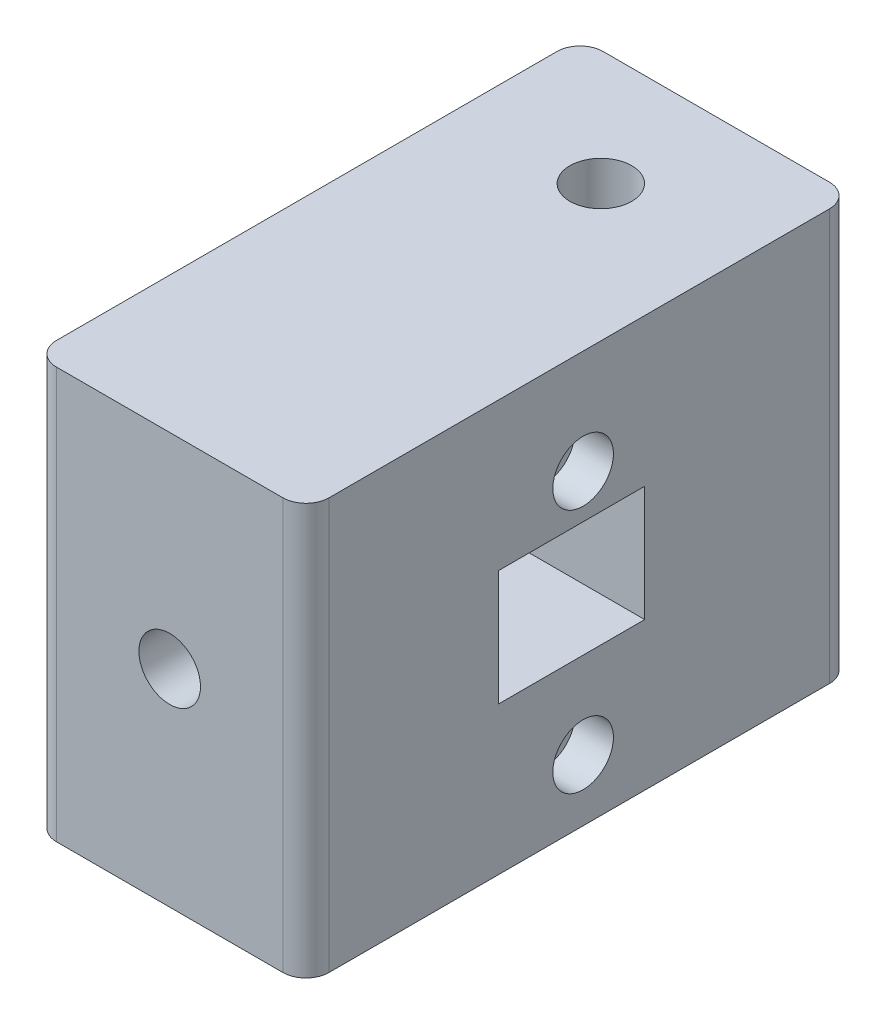
ISO-10303-21;
HEADER;
FILE_DESCRIPTION(('STEP AP214'),'2;1');
FILE_NAME('part.step','',(''),(''),'','','');
FILE_SCHEMA(('AUTOMOTIVE_DESIGN { 1 0 10303 214 1 1 1 1 }'));
ENDSEC;
DATA;
#1=APPLICATION_CONTEXT('core data for automotive mechanical design processes');
#2=APPLICATION_PROTOCOL_DEFINITION('international standard','automotive_design',2000,#1);
#3=PRODUCT_CONTEXT('',#1,'mechanical');
#4=PRODUCT('Part','Part','',(#3));
#5=PRODUCT_RELATED_PRODUCT_CATEGORY('part','',(#4));
#6=PRODUCT_DEFINITION_FORMATION('','',#4);
#7=PRODUCT_DEFINITION_CONTEXT('part definition',#1,'design');
#8=PRODUCT_DEFINITION('design','',#6,#7);
#9=PRODUCT_DEFINITION_SHAPE('','',#8);
#10=(LENGTH_UNIT() NAMED_UNIT(*) SI_UNIT(.MILLI.,.METRE.));
#11=(NAMED_UNIT(*) PLANE_ANGLE_UNIT() SI_UNIT($,.RADIAN.));
#12=(NAMED_UNIT(*) SI_UNIT($,.STERADIAN.) SOLID_ANGLE_UNIT());
#13=UNCERTAINTY_MEASURE_WITH_UNIT(LENGTH_MEASURE(1.E-05),#10,'distance_accuracy_value','');
#14=(GEOMETRIC_REPRESENTATION_CONTEXT(3) GLOBAL_UNCERTAINTY_ASSIGNED_CONTEXT((#13)) GLOBAL_UNIT_ASSIGNED_CONTEXT((#10,
#11,#12)) REPRESENTATION_CONTEXT('',''));
#15=CARTESIAN_POINT('',(0.,0.,0.));
#16=DIRECTION('',(0.,0.,1.));
#17=DIRECTION('',(1.,0.,0.));
#18=AXIS2_PLACEMENT_3D('',#15,#16,#17);
#19=CARTESIAN_POINT('',(22.479,0.,19.05));
#20=DIRECTION('',(0.,1.,0.));
#21=DIRECTION('',(0.,0.,1.));
#22=AXIS2_PLACEMENT_3D('',#19,#20,#21);
#23=CYLINDRICAL_SURFACE('',#22,4.064);
#24=CARTESIAN_POINT('',(22.479,0.,19.05));
#25=DIRECTION('',(0.,1.,0.));
#26=DIRECTION('',(0.,0.,1.));
#27=AXIS2_PLACEMENT_3D('',#24,#25,#26);
#28=CIRCLE('',#27,4.064);
#29=CARTESIAN_POINT('',(22.479,0.,23.114));
#30=VERTEX_POINT('',#29);
#31=EDGE_CURVE('E180',#30,#30,#28,.T.);
#32=ORIENTED_EDGE('',*,*,#31,.F.);
#33=EDGE_LOOP('',(#32));
#34=FACE_BOUND('',#33,.T.);
#35=CARTESIAN_POINT('',(22.479,52.578,19.05));
#36=DIRECTION('',(0.,1.,0.));
#37=DIRECTION('',(0.,0.,1.));
#38=AXIS2_PLACEMENT_3D('',#35,#36,#37);
#39=CIRCLE('',#38,4.064);
#40=CARTESIAN_POINT('',(22.479,52.578,23.114));
#41=VERTEX_POINT('',#40);
#42=EDGE_CURVE('E177',#41,#41,#39,.F.);
#43=ORIENTED_EDGE('',*,*,#42,.F.);
#44=EDGE_LOOP('',(#43));
#45=FACE_BOUND('',#44,.T.);
#46=ADVANCED_FACE('F35',(#34,#45),#23,.F.);
#47=CARTESIAN_POINT('',(0.,0.,90.17));
#48=DIRECTION('',(1.,0.,0.));
#49=DIRECTION('',(0.,0.,-1.));
#50=AXIS2_PLACEMENT_3D('',#47,#48,#49);
#51=PLANE('',#50);
#52=DIRECTION('',(0.,0.,-1.));
#53=VECTOR('',#52,1.);
#54=CARTESIAN_POINT('',(0.,67.818,90.17));
#55=LINE('',#54,#53);
#56=CARTESIAN_POINT('',(0.,67.818,86.36));
#57=VERTEX_POINT('',#56);
#58=CARTESIAN_POINT('',(0.,67.818,3.80999999999999));
#59=VERTEX_POINT('',#58);
#60=EDGE_CURVE('E203',#57,#59,#55,.T.);
#61=ORIENTED_EDGE('',*,*,#60,.T.);
#62=DIRECTION('',(0.,-1.,0.));
#63=VECTOR('',#62,1.);
#64=CARTESIAN_POINT('',(0.,0.,3.80999999999999));
#65=LINE('',#64,#63);
#66=CARTESIAN_POINT('',(0.,0.,3.80999999999999));
#67=VERTEX_POINT('',#66);
#68=EDGE_CURVE('E224',#59,#67,#65,.T.);
#69=ORIENTED_EDGE('',*,*,#68,.T.);
#70=DIRECTION('',(0.,0.,-1.));
#71=VECTOR('',#70,1.);
#72=CARTESIAN_POINT('',(0.,0.,90.17));
#73=LINE('',#72,#71);
#74=CARTESIAN_POINT('',(0.,0.,86.36));
#75=VERTEX_POINT('',#74);
#76=EDGE_CURVE('E215',#75,#67,#73,.T.);
#77=ORIENTED_EDGE('',*,*,#76,.F.);
#78=DIRECTION('',(0.,-1.,0.));
#79=VECTOR('',#78,1.);
#80=CARTESIAN_POINT('',(0.,0.,86.36));
#81=LINE('',#80,#79);
#82=EDGE_CURVE('E218',#75,#57,#81,.F.);
#83=ORIENTED_EDGE('',*,*,#82,.T.);
#84=EDGE_LOOP('',(#61,#69,#77,#83));
#85=FACE_BOUND('',#84,.T.);
#86=ADVANCED_FACE('F281',(#85),#51,.F.);
#87=CARTESIAN_POINT('',(0.,0.,90.17));
#88=DIRECTION('',(0.,1.,0.));
#89=DIRECTION('',(0.,0.,1.));
#90=AXIS2_PLACEMENT_3D('',#87,#88,#89);
#91=PLANE('',#90);
#92=ORIENTED_EDGE('',*,*,#31,.T.);
#93=EDGE_LOOP('',(#92));
#94=FACE_BOUND('',#93,.T.);
#95=ORIENTED_EDGE('',*,*,#76,.T.);
#96=CARTESIAN_POINT('',(3.81,0.,3.80999999999999));
#97=DIRECTION('',(0.,1.,0.));
#98=DIRECTION('',(0.,0.,1.));
#99=AXIS2_PLACEMENT_3D('',#96,#97,#98);
#100=CIRCLE('',#99,3.81);
#101=CARTESIAN_POINT('',(3.81,0.,0.));
#102=VERTEX_POINT('',#101);
#103=EDGE_CURVE('E233',#67,#102,#100,.F.);
#104=ORIENTED_EDGE('',*,*,#103,.T.);
#105=DIRECTION('',(1.,0.,0.));
#106=VECTOR('',#105,1.);
#107=CARTESIAN_POINT('',(0.,0.,0.));
#108=LINE('',#107,#106);
#109=CARTESIAN_POINT('',(41.148,0.,0.));
#110=VERTEX_POINT('',#109);
#111=EDGE_CURVE('E187',#102,#110,#108,.T.);
#112=ORIENTED_EDGE('',*,*,#111,.T.);
#113=CARTESIAN_POINT('',(41.148,0.,3.80999999999999));
#114=DIRECTION('',(0.,1.,0.));
#115=DIRECTION('',(0.,0.,1.));
#116=AXIS2_PLACEMENT_3D('',#113,#114,#115);
#117=CIRCLE('',#116,3.81);
#118=CARTESIAN_POINT('',(44.958,0.,3.80999999999999));
#119=VERTEX_POINT('',#118);
#120=EDGE_CURVE('E231',#110,#119,#117,.F.);
#121=ORIENTED_EDGE('',*,*,#120,.T.);
#122=DIRECTION('',(0.,0.,-1.));
#123=VECTOR('',#122,1.);
#124=CARTESIAN_POINT('',(44.958,0.,90.17));
#125=LINE('',#124,#123);
#126=CARTESIAN_POINT('',(44.958,0.,86.36));
#127=VERTEX_POINT('',#126);
#128=EDGE_CURVE('E212',#127,#119,#125,.T.);
#129=ORIENTED_EDGE('',*,*,#128,.F.);
#130=CARTESIAN_POINT('',(41.148,0.,86.36));
#131=DIRECTION('',(0.,1.,0.));
#132=DIRECTION('',(0.,0.,1.));
#133=AXIS2_PLACEMENT_3D('',#130,#131,#132);
#134=CIRCLE('',#133,3.81);
#135=CARTESIAN_POINT('',(41.148,0.,90.17));
#136=VERTEX_POINT('',#135);
#137=EDGE_CURVE('E227',#127,#136,#134,.F.);
#138=ORIENTED_EDGE('',*,*,#137,.T.);
#139=DIRECTION('',(1.,0.,0.));
#140=VECTOR('',#139,1.);
#141=CARTESIAN_POINT('',(0.,0.,90.17));
#142=LINE('',#141,#140);
#143=CARTESIAN_POINT('',(3.81,0.,90.17));
#144=VERTEX_POINT('',#143);
#145=EDGE_CURVE('E196',#144,#136,#142,.T.);
#146=ORIENTED_EDGE('',*,*,#145,.F.);
#147=CARTESIAN_POINT('',(3.81,0.,86.36));
#148=DIRECTION('',(0.,1.,0.));
#149=DIRECTION('',(0.,0.,1.));
#150=AXIS2_PLACEMENT_3D('',#147,#148,#149);
#151=CIRCLE('',#150,3.81);
#152=EDGE_CURVE('E229',#144,#75,#151,.F.);
#153=ORIENTED_EDGE('',*,*,#152,.T.);
#154=EDGE_LOOP('',(#95,#104,#112,#121,#129,#138,#146,#153));
#155=FACE_BOUND('',#154,.T.);
#156=ADVANCED_FACE('F263',(#94,#155),#91,.F.);
#157=CARTESIAN_POINT('',(44.958,0.,90.17));
#158=DIRECTION('',(-1.,0.,0.));
#159=DIRECTION('',(0.,0.,1.));
#160=AXIS2_PLACEMENT_3D('',#157,#158,#159);
#161=PLANE('',#160);
#162=DIRECTION('',(0.,0.,-1.));
#163=VECTOR('',#162,1.);
#164=CARTESIAN_POINT('',(44.958,24.384,58.42));
#165=LINE('',#164,#163);
#166=CARTESIAN_POINT('',(44.958,24.384,58.42));
#167=VERTEX_POINT('',#166);
#168=CARTESIAN_POINT('',(44.958,24.384,34.29));
#169=VERTEX_POINT('',#168);
#170=EDGE_CURVE('E160',#167,#169,#165,.T.);
#171=ORIENTED_EDGE('',*,*,#170,.F.);
#172=DIRECTION('',(0.,-1.,0.));
#173=VECTOR('',#172,1.);
#174=CARTESIAN_POINT('',(44.958,43.434,58.42));
#175=LINE('',#174,#173);
#176=CARTESIAN_POINT('',(44.958,43.434,58.42));
#177=VERTEX_POINT('',#176);
#178=EDGE_CURVE('E134',#177,#167,#175,.T.);
#179=ORIENTED_EDGE('',*,*,#178,.F.);
#180=DIRECTION('',(0.,0.,1.));
#181=VECTOR('',#180,1.);
#182=CARTESIAN_POINT('',(44.958,43.434,58.42));
#183=LINE('',#182,#181);
#184=CARTESIAN_POINT('',(44.958,43.434,34.29));
#185=VERTEX_POINT('',#184);
#186=EDGE_CURVE('E151',#185,#177,#183,.T.);
#187=ORIENTED_EDGE('',*,*,#186,.F.);
#188=DIRECTION('',(0.,1.,0.));
#189=VECTOR('',#188,1.);
#190=CARTESIAN_POINT('',(44.958,43.434,34.29));
#191=LINE('',#190,#189);
#192=EDGE_CURVE('E154',#169,#185,#191,.T.);
#193=ORIENTED_EDGE('',*,*,#192,.F.);
#194=EDGE_LOOP('',(#171,#179,#187,#193));
#195=FACE_BOUND('',#194,.T.);
#196=CARTESIAN_POINT('',(44.958,50.66,44.45));
#197=DIRECTION('',(1.,0.,0.));
#198=DIRECTION('',(0.,0.,-1.));
#199=AXIS2_PLACEMENT_3D('',#196,#197,#198);
#200=CIRCLE('',#199,5.);
#201=CARTESIAN_POINT('',(44.958,50.66,39.45));
#202=VERTEX_POINT('',#201);
#203=EDGE_CURVE('E188',#202,#202,#200,.T.);
#204=ORIENTED_EDGE('',*,*,#203,.F.);
#205=EDGE_LOOP('',(#204));
#206=FACE_BOUND('',#205,.T.);
#207=CARTESIAN_POINT('',(44.958,10.16,44.45));
#208=DIRECTION('',(1.,0.,0.));
#209=DIRECTION('',(0.,0.,-1.));
#210=AXIS2_PLACEMENT_3D('',#207,#208,#209);
#211=CIRCLE('',#210,5.);
#212=CARTESIAN_POINT('',(44.958,10.16,39.45));
#213=VERTEX_POINT('',#212);
#214=EDGE_CURVE('E183',#213,#213,#211,.T.);
#215=ORIENTED_EDGE('',*,*,#214,.F.);
#216=EDGE_LOOP('',(#215));
#217=FACE_BOUND('',#216,.T.);
#218=ORIENTED_EDGE('',*,*,#128,.T.);
#219=DIRECTION('',(0.,1.,0.));
#220=VECTOR('',#219,1.);
#221=CARTESIAN_POINT('',(44.958,67.818,3.80999999999999));
#222=LINE('',#221,#220);
#223=CARTESIAN_POINT('',(44.958,67.818,3.80999999999999));
#224=VERTEX_POINT('',#223);
#225=EDGE_CURVE('E247',#119,#224,#222,.T.);
#226=ORIENTED_EDGE('',*,*,#225,.T.);
#227=DIRECTION('',(0.,0.,-1.));
#228=VECTOR('',#227,1.);
#229=CARTESIAN_POINT('',(44.958,67.818,90.17));
#230=LINE('',#229,#228);
#231=CARTESIAN_POINT('',(44.958,67.818,86.36));
#232=VERTEX_POINT('',#231);
#233=EDGE_CURVE('E210',#232,#224,#230,.T.);
#234=ORIENTED_EDGE('',*,*,#233,.F.);
#235=DIRECTION('',(0.,1.,0.));
#236=VECTOR('',#235,1.);
#237=CARTESIAN_POINT('',(44.958,0.,86.36));
#238=LINE('',#237,#236);
#239=EDGE_CURVE('E245',#232,#127,#238,.F.);
#240=ORIENTED_EDGE('',*,*,#239,.T.);
#241=EDGE_LOOP('',(#218,#226,#234,#240));
#242=FACE_BOUND('',#241,.T.);
#243=ADVANCED_FACE('F268',(#195,#206,#217,#242),#161,.F.);
#244=CARTESIAN_POINT('',(0.,67.818,90.17));
#245=DIRECTION('',(0.,-1.,0.));
#246=DIRECTION('',(0.,0.,-1.));
#247=AXIS2_PLACEMENT_3D('',#244,#245,#246);
#248=PLANE('',#247);
#249=CARTESIAN_POINT('',(22.479,67.818,19.05));
#250=DIRECTION('',(0.,1.,0.));
#251=DIRECTION('',(0.,0.,1.));
#252=AXIS2_PLACEMENT_3D('',#249,#250,#251);
#253=CIRCLE('',#252,5.1);
#254=CARTESIAN_POINT('',(22.479,67.818,24.15));
#255=VERTEX_POINT('',#254);
#256=EDGE_CURVE('E173',#255,#255,#253,.T.);
#257=ORIENTED_EDGE('',*,*,#256,.F.);
#258=EDGE_LOOP('',(#257));
#259=FACE_BOUND('',#258,.T.);
#260=DIRECTION('',(-1.,0.,0.));
#261=VECTOR('',#260,1.);
#262=CARTESIAN_POINT('',(0.,67.818,0.));
#263=LINE('',#262,#261);
#264=CARTESIAN_POINT('',(41.148,67.818,0.));
#265=VERTEX_POINT('',#264);
#266=CARTESIAN_POINT('',(3.81,67.818,0.));
#267=VERTEX_POINT('',#266);
#268=EDGE_CURVE('E200',#265,#267,#263,.T.);
#269=ORIENTED_EDGE('',*,*,#268,.T.);
#270=CARTESIAN_POINT('',(3.81,67.818,3.80999999999999));
#271=DIRECTION('',(0.,-1.,0.));
#272=DIRECTION('',(0.,0.,-1.));
#273=AXIS2_PLACEMENT_3D('',#270,#271,#272);
#274=CIRCLE('',#273,3.81);
#275=EDGE_CURVE('E243',#267,#59,#274,.F.);
#276=ORIENTED_EDGE('',*,*,#275,.T.);
#277=ORIENTED_EDGE('',*,*,#60,.F.);
#278=CARTESIAN_POINT('',(3.81,67.818,86.36));
#279=DIRECTION('',(0.,-1.,0.));
#280=DIRECTION('',(0.,0.,-1.));
#281=AXIS2_PLACEMENT_3D('',#278,#279,#280);
#282=CIRCLE('',#281,3.81);
#283=CARTESIAN_POINT('',(3.81,67.818,90.17));
#284=VERTEX_POINT('',#283);
#285=EDGE_CURVE('E240',#57,#284,#282,.F.);
#286=ORIENTED_EDGE('',*,*,#285,.T.);
#287=DIRECTION('',(-1.,0.,0.));
#288=VECTOR('',#287,1.);
#289=CARTESIAN_POINT('',(0.,67.818,90.17));
#290=LINE('',#289,#288);
#291=CARTESIAN_POINT('',(41.148,67.818,90.17));
#292=VERTEX_POINT('',#291);
#293=EDGE_CURVE('E199',#292,#284,#290,.T.);
#294=ORIENTED_EDGE('',*,*,#293,.F.);
#295=CARTESIAN_POINT('',(41.148,67.818,86.36));
#296=DIRECTION('',(0.,-1.,0.));
#297=DIRECTION('',(0.,0.,-1.));
#298=AXIS2_PLACEMENT_3D('',#295,#296,#297);
#299=CIRCLE('',#298,3.81);
#300=EDGE_CURVE('E58',#292,#232,#299,.F.);
#301=ORIENTED_EDGE('',*,*,#300,.T.);
#302=ORIENTED_EDGE('',*,*,#233,.T.);
#303=CARTESIAN_POINT('',(41.148,67.818,3.80999999999999));
#304=DIRECTION('',(0.,-1.,0.));
#305=DIRECTION('',(0.,0.,-1.));
#306=AXIS2_PLACEMENT_3D('',#303,#304,#305);
#307=CIRCLE('',#306,3.81);
#308=EDGE_CURVE('E50',#224,#265,#307,.F.);
#309=ORIENTED_EDGE('',*,*,#308,.T.);
#310=EDGE_LOOP('',(#269,#276,#277,#286,#294,#301,#302,#309));
#311=FACE_BOUND('',#310,.T.);
#312=ADVANCED_FACE('F256',(#259,#311),#248,.F.);
#313=CARTESIAN_POINT('',(0.,0.,90.17));
#314=DIRECTION('',(0.,0.,-1.));
#315=DIRECTION('',(-1.,0.,0.));
#316=AXIS2_PLACEMENT_3D('',#313,#314,#315);
#317=PLANE('',#316);
#318=CARTESIAN_POINT('',(22.479,34.036,90.17));
#319=DIRECTION('',(0.,0.,1.));
#320=DIRECTION('',(1.,0.,0.));
#321=AXIS2_PLACEMENT_3D('',#318,#319,#320);
#322=CIRCLE('',#321,5.08);
#323=CARTESIAN_POINT('',(27.559,34.036,90.17));
#324=VERTEX_POINT('',#323);
#325=EDGE_CURVE('E170',#324,#324,#322,.T.);
#326=ORIENTED_EDGE('',*,*,#325,.F.);
#327=EDGE_LOOP('',(#326));
#328=FACE_BOUND('',#327,.T.);
#329=ORIENTED_EDGE('',*,*,#293,.T.);
#330=DIRECTION('',(0.,-1.,0.));
#331=VECTOR('',#330,1.);
#332=CARTESIAN_POINT('',(3.81,0.,90.17));
#333=LINE('',#332,#331);
#334=EDGE_CURVE('E11',#284,#144,#333,.T.);
#335=ORIENTED_EDGE('',*,*,#334,.T.);
#336=ORIENTED_EDGE('',*,*,#145,.T.);
#337=DIRECTION('',(0.,1.,0.));
#338=VECTOR('',#337,1.);
#339=CARTESIAN_POINT('',(41.148,0.,90.17));
#340=LINE('',#339,#338);
#341=EDGE_CURVE('E43',#136,#292,#340,.T.);
#342=ORIENTED_EDGE('',*,*,#341,.T.);
#343=EDGE_LOOP('',(#329,#335,#336,#342));
#344=FACE_BOUND('',#343,.T.);
#345=ADVANCED_FACE('F251',(#328,#344),#317,.F.);
#346=CARTESIAN_POINT('',(0.,0.,0.));
#347=DIRECTION('',(0.,0.,-1.));
#348=DIRECTION('',(-1.,0.,0.));
#349=AXIS2_PLACEMENT_3D('',#346,#347,#348);
#350=PLANE('',#349);
#351=ORIENTED_EDGE('',*,*,#111,.F.);
#352=DIRECTION('',(0.,-1.,0.));
#353=VECTOR('',#352,1.);
#354=CARTESIAN_POINT('',(3.81,67.818,0.));
#355=LINE('',#354,#353);
#356=EDGE_CURVE('E237',#102,#267,#355,.F.);
#357=ORIENTED_EDGE('',*,*,#356,.T.);
#358=ORIENTED_EDGE('',*,*,#268,.F.);
#359=DIRECTION('',(0.,1.,0.));
#360=VECTOR('',#359,1.);
#361=CARTESIAN_POINT('',(41.148,0.,0.));
#362=LINE('',#361,#360);
#363=EDGE_CURVE('E235',#265,#110,#362,.F.);
#364=ORIENTED_EDGE('',*,*,#363,.T.);
#365=EDGE_LOOP('',(#351,#357,#358,#364));
#366=FACE_BOUND('',#365,.T.);
#367=ADVANCED_FACE('F273',(#366),#350,.T.);
#368=CARTESIAN_POINT('',(38.608,10.16,44.45));
#369=DIRECTION('',(1.,0.,0.));
#370=DIRECTION('',(0.,0.,-1.));
#371=AXIS2_PLACEMENT_3D('',#368,#369,#370);
#372=CYLINDRICAL_SURFACE('',#371,5.);
#373=CARTESIAN_POINT('',(38.608,10.16,44.45));
#374=DIRECTION('',(1.,0.,0.));
#375=DIRECTION('',(0.,0.,-1.));
#376=AXIS2_PLACEMENT_3D('',#373,#374,#375);
#377=CIRCLE('',#376,5.);
#378=CARTESIAN_POINT('',(38.608,10.16,39.45));
#379=VERTEX_POINT('',#378);
#380=EDGE_CURVE('E191',#379,#379,#377,.T.);
#381=ORIENTED_EDGE('',*,*,#380,.F.);
#382=EDGE_LOOP('',(#381));
#383=FACE_BOUND('',#382,.T.);
#384=ORIENTED_EDGE('',*,*,#214,.T.);
#385=EDGE_LOOP('',(#384));
#386=FACE_BOUND('',#385,.T.);
#387=ADVANCED_FACE('F330',(#383,#386),#372,.F.);
#388=CARTESIAN_POINT('',(38.608,10.16,44.45));
#389=DIRECTION('',(1.,0.,0.));
#390=DIRECTION('',(0.,0.,-1.));
#391=AXIS2_PLACEMENT_3D('',#388,#389,#390);
#392=PLANE('',#391);
#393=ORIENTED_EDGE('',*,*,#380,.T.);
#394=EDGE_LOOP('',(#393));
#395=FACE_BOUND('',#394,.T.);
#396=ADVANCED_FACE('F466',(#395),#392,.T.);
#397=CARTESIAN_POINT('',(38.608,50.66,44.45));
#398=DIRECTION('',(1.,0.,0.));
#399=DIRECTION('',(0.,0.,-1.));
#400=AXIS2_PLACEMENT_3D('',#397,#398,#399);
#401=CYLINDRICAL_SURFACE('',#400,5.);
#402=CARTESIAN_POINT('',(38.608,50.66,44.45));
#403=DIRECTION('',(1.,0.,0.));
#404=DIRECTION('',(0.,0.,-1.));
#405=AXIS2_PLACEMENT_3D('',#402,#403,#404);
#406=CIRCLE('',#405,5.);
#407=CARTESIAN_POINT('',(38.608,50.66,39.45));
#408=VERTEX_POINT('',#407);
#409=EDGE_CURVE('E184',#408,#408,#406,.T.);
#410=ORIENTED_EDGE('',*,*,#409,.F.);
#411=EDGE_LOOP('',(#410));
#412=FACE_BOUND('',#411,.T.);
#413=ORIENTED_EDGE('',*,*,#203,.T.);
#414=EDGE_LOOP('',(#413));
#415=FACE_BOUND('',#414,.T.);
#416=ADVANCED_FACE('F456',(#412,#415),#401,.F.);
#417=CARTESIAN_POINT('',(38.608,50.66,44.45));
#418=DIRECTION('',(1.,0.,0.));
#419=DIRECTION('',(0.,0.,-1.));
#420=AXIS2_PLACEMENT_3D('',#417,#418,#419);
#421=PLANE('',#420);
#422=ORIENTED_EDGE('',*,*,#409,.T.);
#423=EDGE_LOOP('',(#422));
#424=FACE_BOUND('',#423,.T.);
#425=ADVANCED_FACE('F440',(#424),#421,.T.);
#426=CARTESIAN_POINT('',(22.479,52.578,19.05));
#427=DIRECTION('',(0.,1.,0.));
#428=DIRECTION('',(0.,0.,1.));
#429=AXIS2_PLACEMENT_3D('',#426,#427,#428);
#430=PLANE('',#429);
#431=CARTESIAN_POINT('',(22.479,52.578,19.05));
#432=DIRECTION('',(0.,1.,0.));
#433=DIRECTION('',(0.,0.,1.));
#434=AXIS2_PLACEMENT_3D('',#431,#432,#433);
#435=CIRCLE('',#434,5.1);
#436=CARTESIAN_POINT('',(22.479,52.578,24.15));
#437=VERTEX_POINT('',#436);
#438=EDGE_CURVE('E174',#437,#437,#435,.T.);
#439=ORIENTED_EDGE('',*,*,#438,.T.);
#440=EDGE_LOOP('',(#439));
#441=FACE_BOUND('',#440,.T.);
#442=ORIENTED_EDGE('',*,*,#42,.T.);
#443=EDGE_LOOP('',(#442));
#444=FACE_BOUND('',#443,.T.);
#445=ADVANCED_FACE('F430',(#441,#444),#430,.T.);
#446=CARTESIAN_POINT('',(22.479,52.578,19.05));
#447=DIRECTION('',(0.,1.,0.));
#448=DIRECTION('',(0.,0.,1.));
#449=AXIS2_PLACEMENT_3D('',#446,#447,#448);
#450=CYLINDRICAL_SURFACE('',#449,5.1);
#451=ORIENTED_EDGE('',*,*,#438,.F.);
#452=EDGE_LOOP('',(#451));
#453=FACE_BOUND('',#452,.T.);
#454=ORIENTED_EDGE('',*,*,#256,.T.);
#455=EDGE_LOOP('',(#454));
#456=FACE_BOUND('',#455,.T.);
#457=ADVANCED_FACE('F420',(#453,#456),#450,.F.);
#458=CARTESIAN_POINT('',(22.479,34.036,39.37));
#459=DIRECTION('',(0.,0.,1.));
#460=DIRECTION('',(1.,0.,0.));
#461=AXIS2_PLACEMENT_3D('',#458,#459,#460);
#462=CYLINDRICAL_SURFACE('',#461,5.08);
#463=CARTESIAN_POINT('',(22.479,34.036,58.42));
#464=DIRECTION('',(0.,0.,1.));
#465=DIRECTION('',(1.,0.,0.));
#466=AXIS2_PLACEMENT_3D('',#463,#464,#465);
#467=CIRCLE('',#466,5.08);
#468=CARTESIAN_POINT('',(27.559,34.036,58.42));
#469=VERTEX_POINT('',#468);
#470=EDGE_CURVE('E166',#469,#469,#467,.F.);
#471=ORIENTED_EDGE('',*,*,#470,.T.);
#472=EDGE_LOOP('',(#471));
#473=FACE_BOUND('',#472,.T.);
#474=ORIENTED_EDGE('',*,*,#325,.T.);
#475=EDGE_LOOP('',(#474));
#476=FACE_BOUND('',#475,.T.);
#477=ADVANCED_FACE('F411',(#473,#476),#462,.F.);
#478=CARTESIAN_POINT('',(10.668,43.434,58.42));
#479=DIRECTION('',(0.,0.,1.));
#480=DIRECTION('',(1.,0.,0.));
#481=AXIS2_PLACEMENT_3D('',#478,#479,#480);
#482=PLANE('',#481);
#483=ORIENTED_EDGE('',*,*,#178,.T.);
#484=DIRECTION('',(1.,0.,0.));
#485=VECTOR('',#484,1.);
#486=CARTESIAN_POINT('',(10.668,24.384,58.42));
#487=LINE('',#486,#485);
#488=CARTESIAN_POINT('',(10.668,24.384,58.42));
#489=VERTEX_POINT('',#488);
#490=EDGE_CURVE('E126',#489,#167,#487,.T.);
#491=ORIENTED_EDGE('',*,*,#490,.F.);
#492=DIRECTION('',(0.,-1.,0.));
#493=VECTOR('',#492,1.);
#494=CARTESIAN_POINT('',(10.668,43.434,58.42));
#495=LINE('',#494,#493);
#496=CARTESIAN_POINT('',(10.668,43.434,58.42));
#497=VERTEX_POINT('',#496);
#498=EDGE_CURVE('E131',#497,#489,#495,.T.);
#499=ORIENTED_EDGE('',*,*,#498,.F.);
#500=DIRECTION('',(1.,0.,0.));
#501=VECTOR('',#500,1.);
#502=CARTESIAN_POINT('',(10.668,43.434,58.42));
#503=LINE('',#502,#501);
#504=EDGE_CURVE('E164',#497,#177,#503,.T.);
#505=ORIENTED_EDGE('',*,*,#504,.T.);
#506=EDGE_LOOP('',(#483,#491,#499,#505));
#507=FACE_BOUND('',#506,.T.);
#508=ORIENTED_EDGE('',*,*,#470,.F.);
#509=EDGE_LOOP('',(#508));
#510=FACE_BOUND('',#509,.T.);
#511=ADVANCED_FACE('F128',(#507,#510),#482,.F.);
#512=CARTESIAN_POINT('',(10.668,43.434,58.42));
#513=DIRECTION('',(0.,1.,0.));
#514=DIRECTION('',(0.,0.,1.));
#515=AXIS2_PLACEMENT_3D('',#512,#513,#514);
#516=PLANE('',#515);
#517=ORIENTED_EDGE('',*,*,#186,.T.);
#518=ORIENTED_EDGE('',*,*,#504,.F.);
#519=DIRECTION('',(0.,0.,1.));
#520=VECTOR('',#519,1.);
#521=CARTESIAN_POINT('',(10.668,43.434,58.42));
#522=LINE('',#521,#520);
#523=CARTESIAN_POINT('',(10.668,43.434,34.29));
#524=VERTEX_POINT('',#523);
#525=EDGE_CURVE('E139',#524,#497,#522,.T.);
#526=ORIENTED_EDGE('',*,*,#525,.F.);
#527=DIRECTION('',(1.,0.,0.));
#528=VECTOR('',#527,1.);
#529=CARTESIAN_POINT('',(10.668,43.434,34.29));
#530=LINE('',#529,#528);
#531=EDGE_CURVE('E167',#524,#185,#530,.T.);
#532=ORIENTED_EDGE('',*,*,#531,.T.);
#533=EDGE_LOOP('',(#517,#518,#526,#532));
#534=FACE_BOUND('',#533,.T.);
#535=ADVANCED_FACE('F392',(#534),#516,.F.);
#536=CARTESIAN_POINT('',(10.668,43.434,34.29));
#537=DIRECTION('',(0.,0.,-1.));
#538=DIRECTION('',(0.,1.,0.));
#539=AXIS2_PLACEMENT_3D('',#536,#537,#538);
#540=PLANE('',#539);
#541=ORIENTED_EDGE('',*,*,#192,.T.);
#542=ORIENTED_EDGE('',*,*,#531,.F.);
#543=DIRECTION('',(0.,1.,0.));
#544=VECTOR('',#543,1.);
#545=CARTESIAN_POINT('',(10.668,43.434,34.29));
#546=LINE('',#545,#544);
#547=CARTESIAN_POINT('',(10.668,24.384,34.29));
#548=VERTEX_POINT('',#547);
#549=EDGE_CURVE('E147',#548,#524,#546,.T.);
#550=ORIENTED_EDGE('',*,*,#549,.F.);
#551=DIRECTION('',(1.,0.,0.));
#552=VECTOR('',#551,1.);
#553=CARTESIAN_POINT('',(10.668,24.384,34.29));
#554=LINE('',#553,#552);
#555=EDGE_CURVE('E138',#548,#169,#554,.T.);
#556=ORIENTED_EDGE('',*,*,#555,.T.);
#557=EDGE_LOOP('',(#541,#542,#550,#556));
#558=FACE_BOUND('',#557,.T.);
#559=ADVANCED_FACE('F383',(#558),#540,.F.);
#560=CARTESIAN_POINT('',(10.668,24.384,58.42));
#561=DIRECTION('',(0.,-1.,0.));
#562=DIRECTION('',(0.,0.,-1.));
#563=AXIS2_PLACEMENT_3D('',#560,#561,#562);
#564=PLANE('',#563);
#565=ORIENTED_EDGE('',*,*,#170,.T.);
#566=ORIENTED_EDGE('',*,*,#555,.F.);
#567=DIRECTION('',(0.,0.,-1.));
#568=VECTOR('',#567,1.);
#569=CARTESIAN_POINT('',(10.668,24.384,58.42));
#570=LINE('',#569,#568);
#571=EDGE_CURVE('E142',#489,#548,#570,.T.);
#572=ORIENTED_EDGE('',*,*,#571,.F.);
#573=ORIENTED_EDGE('',*,*,#490,.T.);
#574=EDGE_LOOP('',(#565,#566,#572,#573));
#575=FACE_BOUND('',#574,.T.);
#576=ADVANCED_FACE('F143',(#575),#564,.F.);
#577=CARTESIAN_POINT('',(10.668,0.,0.));
#578=DIRECTION('',(1.,0.,0.));
#579=DIRECTION('',(0.,0.,-1.));
#580=AXIS2_PLACEMENT_3D('',#577,#578,#579);
#581=PLANE('',#580);
#582=ORIENTED_EDGE('',*,*,#498,.T.);
#583=ORIENTED_EDGE('',*,*,#571,.T.);
#584=ORIENTED_EDGE('',*,*,#549,.T.);
#585=ORIENTED_EDGE('',*,*,#525,.T.);
#586=EDGE_LOOP('',(#582,#583,#584,#585));
#587=FACE_BOUND('',#586,.T.);
#588=ADVANCED_FACE('F149',(#587),#581,.T.);
#589=CARTESIAN_POINT('',(3.81,0.,3.80999999999999));
#590=DIRECTION('',(0.,1.,0.));
#591=DIRECTION('',(0.,0.,1.));
#592=AXIS2_PLACEMENT_3D('',#589,#590,#591);
#593=CYLINDRICAL_SURFACE('',#592,3.81);
#594=ORIENTED_EDGE('',*,*,#275,.F.);
#595=ORIENTED_EDGE('',*,*,#356,.F.);
#596=ORIENTED_EDGE('',*,*,#103,.F.);
#597=ORIENTED_EDGE('',*,*,#68,.F.);
#598=EDGE_LOOP('',(#594,#595,#596,#597));
#599=FACE_BOUND('',#598,.T.);
#600=ADVANCED_FACE('F278',(#599),#593,.T.);
#601=CARTESIAN_POINT('',(41.148,0.,3.80999999999999));
#602=DIRECTION('',(0.,-1.,0.));
#603=DIRECTION('',(0.,0.,-1.));
#604=AXIS2_PLACEMENT_3D('',#601,#602,#603);
#605=CYLINDRICAL_SURFACE('',#604,3.81);
#606=ORIENTED_EDGE('',*,*,#120,.F.);
#607=ORIENTED_EDGE('',*,*,#363,.F.);
#608=ORIENTED_EDGE('',*,*,#308,.F.);
#609=ORIENTED_EDGE('',*,*,#225,.F.);
#610=EDGE_LOOP('',(#606,#607,#608,#609));
#611=FACE_BOUND('',#610,.T.);
#612=ADVANCED_FACE('F276',(#611),#605,.T.);
#613=CARTESIAN_POINT('',(3.81,0.,86.36));
#614=DIRECTION('',(0.,-1.,0.));
#615=DIRECTION('',(0.,0.,-1.));
#616=AXIS2_PLACEMENT_3D('',#613,#614,#615);
#617=CYLINDRICAL_SURFACE('',#616,3.81);
#618=ORIENTED_EDGE('',*,*,#285,.F.);
#619=ORIENTED_EDGE('',*,*,#82,.F.);
#620=ORIENTED_EDGE('',*,*,#152,.F.);
#621=ORIENTED_EDGE('',*,*,#334,.F.);
#622=EDGE_LOOP('',(#618,#619,#620,#621));
#623=FACE_BOUND('',#622,.T.);
#624=ADVANCED_FACE('F261',(#623),#617,.T.);
#625=CARTESIAN_POINT('',(41.148,0.,86.36));
#626=DIRECTION('',(0.,1.,0.));
#627=DIRECTION('',(0.,0.,1.));
#628=AXIS2_PLACEMENT_3D('',#625,#626,#627);
#629=CYLINDRICAL_SURFACE('',#628,3.81);
#630=ORIENTED_EDGE('',*,*,#137,.F.);
#631=ORIENTED_EDGE('',*,*,#239,.F.);
#632=ORIENTED_EDGE('',*,*,#300,.F.);
#633=ORIENTED_EDGE('',*,*,#341,.F.);
#634=EDGE_LOOP('',(#630,#631,#632,#633));
#635=FACE_BOUND('',#634,.T.);
#636=ADVANCED_FACE('F37',(#635),#629,.T.);
#637=CLOSED_SHELL('',(#46,#86,#156,#243,#312,#345,#367,#387,#396,#416,#425,#445,#457,#477,#511,
#535,#559,#576,#588,#600,#612,#624,#636));
#638=MANIFOLD_SOLID_BREP('B2',#637);
#639=ADVANCED_BREP_SHAPE_REPRESENTATION('',(#18,#638),#14);
#640=SHAPE_DEFINITION_REPRESENTATION(#9,#639);
ENDSEC;
END-ISO-10303-21;
